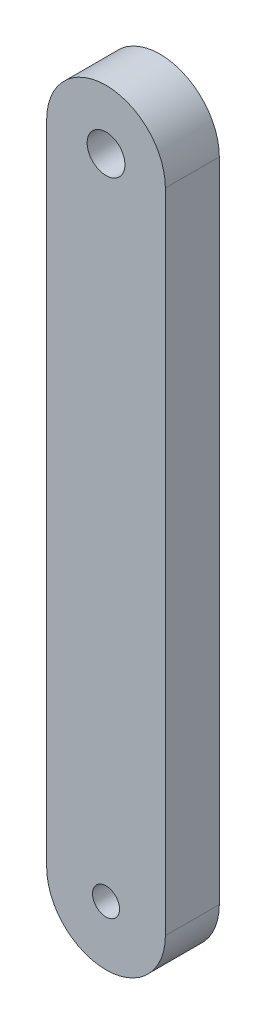
ISO-10303-21;
HEADER;
FILE_DESCRIPTION(('STEP AP214'),'2;1');
FILE_NAME('part.step','',(''),(''),'','','');
FILE_SCHEMA(('AUTOMOTIVE_DESIGN { 1 0 10303 214 1 1 1 1 }'));
ENDSEC;
DATA;
#1=APPLICATION_CONTEXT('core data for automotive mechanical design processes');
#2=APPLICATION_PROTOCOL_DEFINITION('international standard','automotive_design',2000,#1);
#3=PRODUCT_CONTEXT('',#1,'mechanical');
#4=PRODUCT('Part','Part','',(#3));
#5=PRODUCT_RELATED_PRODUCT_CATEGORY('part','',(#4));
#6=PRODUCT_DEFINITION_FORMATION('','',#4);
#7=PRODUCT_DEFINITION_CONTEXT('part definition',#1,'design');
#8=PRODUCT_DEFINITION('design','',#6,#7);
#9=PRODUCT_DEFINITION_SHAPE('','',#8);
#10=(LENGTH_UNIT() NAMED_UNIT(*) SI_UNIT(.MILLI.,.METRE.));
#11=(NAMED_UNIT(*) PLANE_ANGLE_UNIT() SI_UNIT($,.RADIAN.));
#12=(NAMED_UNIT(*) SI_UNIT($,.STERADIAN.) SOLID_ANGLE_UNIT());
#13=UNCERTAINTY_MEASURE_WITH_UNIT(LENGTH_MEASURE(1.E-05),#10,'distance_accuracy_value','');
#14=(GEOMETRIC_REPRESENTATION_CONTEXT(3) GLOBAL_UNCERTAINTY_ASSIGNED_CONTEXT((#13)) GLOBAL_UNIT_ASSIGNED_CONTEXT((#10,
#11,#12)) REPRESENTATION_CONTEXT('',''));
#15=CARTESIAN_POINT('',(0.,0.,0.));
#16=DIRECTION('',(0.,0.,1.));
#17=DIRECTION('',(1.,0.,0.));
#18=AXIS2_PLACEMENT_3D('',#15,#16,#17);
#19=CARTESIAN_POINT('',(381.909457728598,359.244133276686,5.));
#20=DIRECTION('',(0.,0.,1.));
#21=DIRECTION('',(1.,0.,0.));
#22=AXIS2_PLACEMENT_3D('',#19,#20,#21);
#23=PLANE('',#22);
#24=CARTESIAN_POINT('',(381.909457728598,359.244133276686,5.));
#25=DIRECTION('',(0.,0.,1.));
#26=DIRECTION('',(1.,0.,0.));
#27=AXIS2_PLACEMENT_3D('',#24,#25,#26);
#28=CIRCLE('',#27,1.25000000000001);
#29=CARTESIAN_POINT('',(383.159457728598,359.244133276686,5.));
#30=VERTEX_POINT('',#29);
#31=EDGE_CURVE('E100',#30,#30,#28,.T.);
#32=ORIENTED_EDGE('',*,*,#31,.F.);
#33=EDGE_LOOP('',(#32));
#34=FACE_BOUND('',#33,.T.);
#35=CARTESIAN_POINT('',(381.909457728598,359.244133276686,5.));
#36=DIRECTION('',(0.,0.,1.));
#37=DIRECTION('',(1.,0.,0.));
#38=AXIS2_PLACEMENT_3D('',#35,#36,#37);
#39=CIRCLE('',#38,5.50000000000001);
#40=CARTESIAN_POINT('',(376.409457728598,359.244133276686,5.));
#41=VERTEX_POINT('',#40);
#42=CARTESIAN_POINT('',(387.409457728598,359.244133276686,5.));
#43=VERTEX_POINT('',#42);
#44=EDGE_CURVE('E85',#41,#43,#39,.T.);
#45=ORIENTED_EDGE('',*,*,#44,.T.);
#46=DIRECTION('',(0.,1.,0.));
#47=VECTOR('',#46,1.);
#48=CARTESIAN_POINT('',(387.409457728598,359.244133276686,5.));
#49=LINE('',#48,#47);
#50=CARTESIAN_POINT('',(387.409457728598,419.244133276686,5.));
#51=VERTEX_POINT('',#50);
#52=EDGE_CURVE('E80',#43,#51,#49,.T.);
#53=ORIENTED_EDGE('',*,*,#52,.T.);
#54=CARTESIAN_POINT('',(381.909457728598,419.244133276686,5.));
#55=DIRECTION('',(0.,0.,1.));
#56=DIRECTION('',(1.,0.,0.));
#57=AXIS2_PLACEMENT_3D('',#54,#55,#56);
#58=CIRCLE('',#57,5.50000000000001);
#59=CARTESIAN_POINT('',(376.409457728598,419.244133276686,5.));
#60=VERTEX_POINT('',#59);
#61=EDGE_CURVE('E83',#51,#60,#58,.T.);
#62=ORIENTED_EDGE('',*,*,#61,.T.);
#63=DIRECTION('',(0.,-1.,0.));
#64=VECTOR('',#63,1.);
#65=CARTESIAN_POINT('',(376.409457728598,419.244133276686,5.));
#66=LINE('',#65,#64);
#67=EDGE_CURVE('E50',#60,#41,#66,.T.);
#68=ORIENTED_EDGE('',*,*,#67,.T.);
#69=EDGE_LOOP('',(#45,#53,#62,#68));
#70=FACE_BOUND('',#69,.T.);
#71=CARTESIAN_POINT('',(381.909457728598,419.244133276686,5.));
#72=DIRECTION('',(0.,0.,1.));
#73=DIRECTION('',(1.,0.,0.));
#74=AXIS2_PLACEMENT_3D('',#71,#72,#73);
#75=CIRCLE('',#74,1.74999999999998);
#76=CARTESIAN_POINT('',(383.659457728598,419.244133276686,5.));
#77=VERTEX_POINT('',#76);
#78=EDGE_CURVE('E115',#77,#77,#75,.T.);
#79=ORIENTED_EDGE('',*,*,#78,.F.);
#80=EDGE_LOOP('',(#79));
#81=FACE_BOUND('',#80,.T.);
#82=ADVANCED_FACE('F33',(#34,#70,#81),#23,.T.);
#83=CARTESIAN_POINT('',(381.909457728598,359.244133276686,0.));
#84=DIRECTION('',(0.,0.,1.));
#85=DIRECTION('',(1.,0.,0.));
#86=AXIS2_PLACEMENT_3D('',#83,#84,#85);
#87=PLANE('',#86);
#88=CARTESIAN_POINT('',(381.909457728598,359.244133276686,0.));
#89=DIRECTION('',(0.,0.,1.));
#90=DIRECTION('',(1.,0.,0.));
#91=AXIS2_PLACEMENT_3D('',#88,#89,#90);
#92=CIRCLE('',#91,5.50000000000001);
#93=CARTESIAN_POINT('',(376.409457728598,359.244133276686,0.));
#94=VERTEX_POINT('',#93);
#95=CARTESIAN_POINT('',(387.409457728598,359.244133276686,0.));
#96=VERTEX_POINT('',#95);
#97=EDGE_CURVE('E97',#94,#96,#92,.T.);
#98=ORIENTED_EDGE('',*,*,#97,.F.);
#99=DIRECTION('',(0.,-1.,0.));
#100=VECTOR('',#99,1.);
#101=CARTESIAN_POINT('',(376.409457728598,419.244133276686,0.));
#102=LINE('',#101,#100);
#103=CARTESIAN_POINT('',(376.409457728598,419.244133276686,0.));
#104=VERTEX_POINT('',#103);
#105=EDGE_CURVE('E73',#104,#94,#102,.T.);
#106=ORIENTED_EDGE('',*,*,#105,.F.);
#107=CARTESIAN_POINT('',(381.909457728598,419.244133276686,0.));
#108=DIRECTION('',(0.,0.,1.));
#109=DIRECTION('',(1.,0.,0.));
#110=AXIS2_PLACEMENT_3D('',#107,#108,#109);
#111=CIRCLE('',#110,5.50000000000001);
#112=CARTESIAN_POINT('',(387.409457728598,419.244133276686,0.));
#113=VERTEX_POINT('',#112);
#114=EDGE_CURVE('E67',#113,#104,#111,.T.);
#115=ORIENTED_EDGE('',*,*,#114,.F.);
#116=DIRECTION('',(0.,1.,0.));
#117=VECTOR('',#116,1.);
#118=CARTESIAN_POINT('',(387.409457728598,359.244133276686,0.));
#119=LINE('',#118,#117);
#120=EDGE_CURVE('E89',#96,#113,#119,.T.);
#121=ORIENTED_EDGE('',*,*,#120,.F.);
#122=EDGE_LOOP('',(#98,#106,#115,#121));
#123=FACE_BOUND('',#122,.T.);
#124=CARTESIAN_POINT('',(381.909457728598,359.244133276686,0.));
#125=DIRECTION('',(0.,0.,1.));
#126=DIRECTION('',(1.,0.,0.));
#127=AXIS2_PLACEMENT_3D('',#124,#125,#126);
#128=CIRCLE('',#127,1.25000000000001);
#129=CARTESIAN_POINT('',(383.159457728598,359.244133276686,0.));
#130=VERTEX_POINT('',#129);
#131=EDGE_CURVE('E112',#130,#130,#128,.T.);
#132=ORIENTED_EDGE('',*,*,#131,.T.);
#133=EDGE_LOOP('',(#132));
#134=FACE_BOUND('',#133,.T.);
#135=CARTESIAN_POINT('',(381.909457728598,419.244133276686,0.));
#136=DIRECTION('',(0.,0.,1.));
#137=DIRECTION('',(1.,0.,0.));
#138=AXIS2_PLACEMENT_3D('',#135,#136,#137);
#139=CIRCLE('',#138,1.74999999999998);
#140=CARTESIAN_POINT('',(383.659457728598,419.244133276686,0.));
#141=VERTEX_POINT('',#140);
#142=EDGE_CURVE('E118',#141,#141,#139,.T.);
#143=ORIENTED_EDGE('',*,*,#142,.T.);
#144=EDGE_LOOP('',(#143));
#145=FACE_BOUND('',#144,.T.);
#146=ADVANCED_FACE('F108',(#123,#134,#145),#87,.F.);
#147=CARTESIAN_POINT('',(381.909457728598,359.244133276686,5.));
#148=DIRECTION('',(0.,0.,-1.));
#149=DIRECTION('',(-1.,0.,0.));
#150=AXIS2_PLACEMENT_3D('',#147,#148,#149);
#151=CYLINDRICAL_SURFACE('',#150,5.50000000000001);
#152=ORIENTED_EDGE('',*,*,#97,.T.);
#153=DIRECTION('',(0.,0.,-1.));
#154=VECTOR('',#153,1.);
#155=CARTESIAN_POINT('',(387.409457728598,359.244133276686,5.));
#156=LINE('',#155,#154);
#157=EDGE_CURVE('E11',#43,#96,#156,.T.);
#158=ORIENTED_EDGE('',*,*,#157,.F.);
#159=ORIENTED_EDGE('',*,*,#44,.F.);
#160=DIRECTION('',(0.,0.,-1.));
#161=VECTOR('',#160,1.);
#162=CARTESIAN_POINT('',(376.409457728598,359.244133276686,5.));
#163=LINE('',#162,#161);
#164=EDGE_CURVE('E93',#41,#94,#163,.T.);
#165=ORIENTED_EDGE('',*,*,#164,.T.);
#166=EDGE_LOOP('',(#152,#158,#159,#165));
#167=FACE_BOUND('',#166,.T.);
#168=ADVANCED_FACE('F35',(#167),#151,.T.);
#169=CARTESIAN_POINT('',(387.409457728598,359.244133276686,5.));
#170=DIRECTION('',(-1.,0.,0.));
#171=DIRECTION('',(0.,0.,1.));
#172=AXIS2_PLACEMENT_3D('',#169,#170,#171);
#173=PLANE('',#172);
#174=ORIENTED_EDGE('',*,*,#120,.T.);
#175=DIRECTION('',(0.,0.,-1.));
#176=VECTOR('',#175,1.);
#177=CARTESIAN_POINT('',(387.409457728598,419.244133276686,5.));
#178=LINE('',#177,#176);
#179=EDGE_CURVE('E42',#51,#113,#178,.T.);
#180=ORIENTED_EDGE('',*,*,#179,.F.);
#181=ORIENTED_EDGE('',*,*,#52,.F.);
#182=ORIENTED_EDGE('',*,*,#157,.T.);
#183=EDGE_LOOP('',(#174,#180,#181,#182));
#184=FACE_BOUND('',#183,.T.);
#185=ADVANCED_FACE('F88',(#184),#173,.F.);
#186=CARTESIAN_POINT('',(381.909457728598,419.244133276686,5.));
#187=DIRECTION('',(0.,0.,-1.));
#188=DIRECTION('',(-1.,0.,0.));
#189=AXIS2_PLACEMENT_3D('',#186,#187,#188);
#190=CYLINDRICAL_SURFACE('',#189,5.50000000000001);
#191=ORIENTED_EDGE('',*,*,#114,.T.);
#192=DIRECTION('',(0.,0.,-1.));
#193=VECTOR('',#192,1.);
#194=CARTESIAN_POINT('',(376.409457728598,419.244133276686,5.));
#195=LINE('',#194,#193);
#196=EDGE_CURVE('E90',#60,#104,#195,.T.);
#197=ORIENTED_EDGE('',*,*,#196,.F.);
#198=ORIENTED_EDGE('',*,*,#61,.F.);
#199=ORIENTED_EDGE('',*,*,#179,.T.);
#200=EDGE_LOOP('',(#191,#197,#198,#199));
#201=FACE_BOUND('',#200,.T.);
#202=ADVANCED_FACE('F91',(#201),#190,.T.);
#203=CARTESIAN_POINT('',(376.409457728598,419.244133276686,5.));
#204=DIRECTION('',(1.,0.,0.));
#205=DIRECTION('',(0.,0.,-1.));
#206=AXIS2_PLACEMENT_3D('',#203,#204,#205);
#207=PLANE('',#206);
#208=ORIENTED_EDGE('',*,*,#105,.T.);
#209=ORIENTED_EDGE('',*,*,#164,.F.);
#210=ORIENTED_EDGE('',*,*,#67,.F.);
#211=ORIENTED_EDGE('',*,*,#196,.T.);
#212=EDGE_LOOP('',(#208,#209,#210,#211));
#213=FACE_BOUND('',#212,.T.);
#214=ADVANCED_FACE('F105',(#213),#207,.F.);
#215=CARTESIAN_POINT('',(381.909457728598,359.244133276686,5.));
#216=DIRECTION('',(0.,0.,-1.));
#217=DIRECTION('',(-1.,0.,0.));
#218=AXIS2_PLACEMENT_3D('',#215,#216,#217);
#219=CYLINDRICAL_SURFACE('',#218,1.25000000000001);
#220=ORIENTED_EDGE('',*,*,#31,.T.);
#221=EDGE_LOOP('',(#220));
#222=FACE_BOUND('',#221,.T.);
#223=ORIENTED_EDGE('',*,*,#131,.F.);
#224=EDGE_LOOP('',(#223));
#225=FACE_BOUND('',#224,.T.);
#226=ADVANCED_FACE('F135',(#222,#225),#219,.F.);
#227=CARTESIAN_POINT('',(381.909457728598,419.244133276686,5.));
#228=DIRECTION('',(0.,0.,-1.));
#229=DIRECTION('',(-1.,0.,0.));
#230=AXIS2_PLACEMENT_3D('',#227,#228,#229);
#231=CYLINDRICAL_SURFACE('',#230,1.74999999999998);
#232=ORIENTED_EDGE('',*,*,#78,.T.);
#233=EDGE_LOOP('',(#232));
#234=FACE_BOUND('',#233,.T.);
#235=ORIENTED_EDGE('',*,*,#142,.F.);
#236=EDGE_LOOP('',(#235));
#237=FACE_BOUND('',#236,.T.);
#238=ADVANCED_FACE('F124',(#234,#237),#231,.F.);
#239=CLOSED_SHELL('',(#82,#146,#168,#185,#202,#214,#226,#238));
#240=MANIFOLD_SOLID_BREP('B2',#239);
#241=ADVANCED_BREP_SHAPE_REPRESENTATION('',(#18,#240),#14);
#242=SHAPE_DEFINITION_REPRESENTATION(#9,#241);
ENDSEC;
END-ISO-10303-21;
